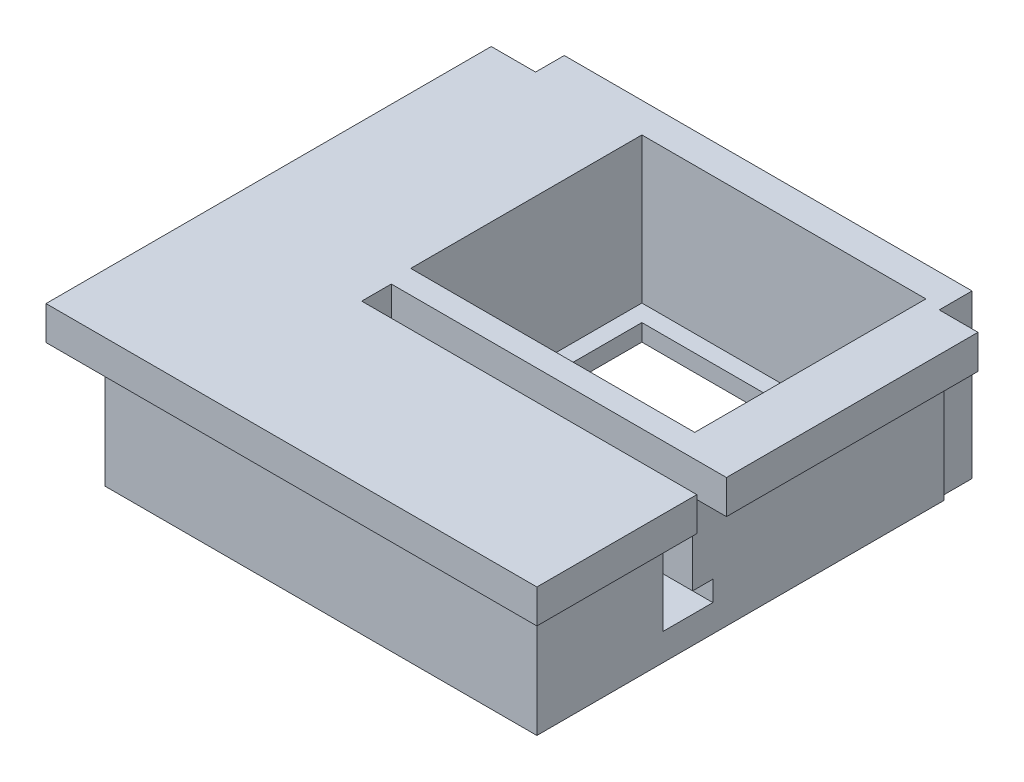
ISO-10303-21;
HEADER;
FILE_DESCRIPTION(('STEP AP214'),'2;1');
FILE_NAME('part.step','',(''),(''),'','','');
FILE_SCHEMA(('AUTOMOTIVE_DESIGN { 1 0 10303 214 1 1 1 1 }'));
ENDSEC;
DATA;
#1=APPLICATION_CONTEXT('core data for automotive mechanical design processes');
#2=APPLICATION_PROTOCOL_DEFINITION('international standard','automotive_design',2000,#1);
#3=PRODUCT_CONTEXT('',#1,'mechanical');
#4=PRODUCT('Part','Part','',(#3));
#5=PRODUCT_RELATED_PRODUCT_CATEGORY('part','',(#4));
#6=PRODUCT_DEFINITION_FORMATION('','',#4);
#7=PRODUCT_DEFINITION_CONTEXT('part definition',#1,'design');
#8=PRODUCT_DEFINITION('design','',#6,#7);
#9=PRODUCT_DEFINITION_SHAPE('','',#8);
#10=(LENGTH_UNIT() NAMED_UNIT(*) SI_UNIT(.MILLI.,.METRE.));
#11=(NAMED_UNIT(*) PLANE_ANGLE_UNIT() SI_UNIT($,.RADIAN.));
#12=(NAMED_UNIT(*) SI_UNIT($,.STERADIAN.) SOLID_ANGLE_UNIT());
#13=UNCERTAINTY_MEASURE_WITH_UNIT(LENGTH_MEASURE(1.E-05),#10,'distance_accuracy_value','');
#14=(GEOMETRIC_REPRESENTATION_CONTEXT(3) GLOBAL_UNCERTAINTY_ASSIGNED_CONTEXT((#13)) GLOBAL_UNIT_ASSIGNED_CONTEXT((#10,
#11,#12)) REPRESENTATION_CONTEXT('',''));
#15=CARTESIAN_POINT('',(0.,0.,0.));
#16=DIRECTION('',(0.,0.,1.));
#17=DIRECTION('',(1.,0.,0.));
#18=AXIS2_PLACEMENT_3D('',#15,#16,#17);
#19=CARTESIAN_POINT('',(-11.7306890976738,-0.899999999999993,-20.615205118863));
#20=DIRECTION('',(0.,0.,1.));
#21=DIRECTION('',(1.,0.,0.));
#22=AXIS2_PLACEMENT_3D('',#19,#20,#21);
#23=PLANE('',#22);
#24=DIRECTION('',(0.,1.,0.));
#25=VECTOR('',#24,1.);
#26=CARTESIAN_POINT('',(-11.7306890976738,-0.899999999999993,-20.615205118863));
#27=LINE('',#26,#25);
#28=CARTESIAN_POINT('',(-11.7306890976738,1.,-20.615205118863));
#29=VERTEX_POINT('',#28);
#30=CARTESIAN_POINT('',(-11.7306890976738,9.6,-20.615205118863));
#31=VERTEX_POINT('',#30);
#32=EDGE_CURVE('E380',#29,#31,#27,.T.);
#33=ORIENTED_EDGE('',*,*,#32,.F.);
#34=DIRECTION('',(-1.,0.,0.));
#35=VECTOR('',#34,1.);
#36=CARTESIAN_POINT('',(-27.5094484476645,1.,-20.615205118863));
#37=LINE('',#36,#35);
#38=CARTESIAN_POINT('',(-28.5094484476645,1.,-20.615205118863));
#39=VERTEX_POINT('',#38);
#40=EDGE_CURVE('E267',#29,#39,#37,.T.);
#41=ORIENTED_EDGE('',*,*,#40,.T.);
#42=DIRECTION('',(0.,1.,0.));
#43=VECTOR('',#42,1.);
#44=CARTESIAN_POINT('',(-28.5094484476645,-0.899999999999993,-20.615205118863));
#45=LINE('',#44,#43);
#46=CARTESIAN_POINT('',(-28.5094484476645,9.6,-20.615205118863));
#47=VERTEX_POINT('',#46);
#48=EDGE_CURVE('E383',#39,#47,#45,.T.);
#49=ORIENTED_EDGE('',*,*,#48,.T.);
#50=DIRECTION('',(1.,0.,0.));
#51=VECTOR('',#50,1.);
#52=CARTESIAN_POINT('',(-11.7306890976738,9.6,-20.615205118863));
#53=LINE('',#52,#51);
#54=EDGE_CURVE('E376',#47,#31,#53,.T.);
#55=ORIENTED_EDGE('',*,*,#54,.T.);
#56=EDGE_LOOP('',(#33,#41,#49,#55));
#57=FACE_BOUND('',#56,.T.);
#58=ADVANCED_FACE('F32',(#57),#23,.F.);
#59=CARTESIAN_POINT('',(-27.5094484476645,0.,0.));
#60=DIRECTION('',(-1.,0.,0.));
#61=DIRECTION('',(0.,0.,1.));
#62=AXIS2_PLACEMENT_3D('',#59,#60,#61);
#63=PLANE('',#62);
#64=DIRECTION('',(0.,1.,0.));
#65=VECTOR('',#64,1.);
#66=CARTESIAN_POINT('',(-27.5094484476645,0.,-21.615205118863));
#67=LINE('',#66,#65);
#68=CARTESIAN_POINT('',(-27.5094484476645,0.,-21.615205118863));
#69=VERTEX_POINT('',#68);
#70=CARTESIAN_POINT('',(-27.5094484476645,1.,-21.615205118863));
#71=VERTEX_POINT('',#70);
#72=EDGE_CURVE('E51',#69,#71,#67,.T.);
#73=ORIENTED_EDGE('',*,*,#72,.F.);
#74=DIRECTION('',(0.,0.,-1.));
#75=VECTOR('',#74,1.);
#76=CARTESIAN_POINT('',(-27.5094484476645,0.,-20.615205118863));
#77=LINE('',#76,#75);
#78=CARTESIAN_POINT('',(-27.5094484476645,0.,-33.2727785424468));
#79=VERTEX_POINT('',#78);
#80=EDGE_CURVE('E241',#69,#79,#77,.T.);
#81=ORIENTED_EDGE('',*,*,#80,.T.);
#82=DIRECTION('',(0.,-1.,0.));
#83=VECTOR('',#82,1.);
#84=CARTESIAN_POINT('',(-27.5094484476645,0.,-33.2727785424468));
#85=LINE('',#84,#83);
#86=CARTESIAN_POINT('',(-27.5094484476645,1.,-33.2727785424468));
#87=VERTEX_POINT('',#86);
#88=EDGE_CURVE('E256',#87,#79,#85,.T.);
#89=ORIENTED_EDGE('',*,*,#88,.F.);
#90=DIRECTION('',(0.,0.,1.));
#91=VECTOR('',#90,1.);
#92=CARTESIAN_POINT('',(-27.5094484476645,1.,-20.615205118863));
#93=LINE('',#92,#91);
#94=EDGE_CURVE('E47',#87,#71,#93,.T.);
#95=ORIENTED_EDGE('',*,*,#94,.T.);
#96=EDGE_LOOP('',(#73,#81,#89,#95));
#97=FACE_BOUND('',#96,.T.);
#98=ADVANCED_FACE('F558',(#97),#63,.F.);
#99=CARTESIAN_POINT('',(-12.7306890976738,0.,0.));
#100=DIRECTION('',(1.,0.,0.));
#101=DIRECTION('',(0.,0.,-1.));
#102=AXIS2_PLACEMENT_3D('',#99,#100,#101);
#103=PLANE('',#102);
#104=DIRECTION('',(0.,-1.,0.));
#105=VECTOR('',#104,1.);
#106=CARTESIAN_POINT('',(-12.7306890976738,0.,-21.615205118863));
#107=LINE('',#106,#105);
#108=CARTESIAN_POINT('',(-12.7306890976738,1.,-21.615205118863));
#109=VERTEX_POINT('',#108);
#110=CARTESIAN_POINT('',(-12.7306890976738,0.,-21.615205118863));
#111=VERTEX_POINT('',#110);
#112=EDGE_CURVE('E228',#109,#111,#107,.T.);
#113=ORIENTED_EDGE('',*,*,#112,.F.);
#114=DIRECTION('',(0.,0.,-1.));
#115=VECTOR('',#114,1.);
#116=CARTESIAN_POINT('',(-12.7306890976738,1.,-33.2727785424468));
#117=LINE('',#116,#115);
#118=CARTESIAN_POINT('',(-12.7306890976738,1.,-33.2727785424468));
#119=VERTEX_POINT('',#118);
#120=EDGE_CURVE('E235',#109,#119,#117,.T.);
#121=ORIENTED_EDGE('',*,*,#120,.T.);
#122=DIRECTION('',(0.,-1.,0.));
#123=VECTOR('',#122,1.);
#124=CARTESIAN_POINT('',(-12.7306890976738,0.,-33.2727785424468));
#125=LINE('',#124,#123);
#126=CARTESIAN_POINT('',(-12.7306890976738,0.,-33.2727785424468));
#127=VERTEX_POINT('',#126);
#128=EDGE_CURVE('E231',#119,#127,#125,.T.);
#129=ORIENTED_EDGE('',*,*,#128,.T.);
#130=DIRECTION('',(0.,0.,1.));
#131=VECTOR('',#130,1.);
#132=CARTESIAN_POINT('',(-12.7306890976738,0.,-33.2727785424468));
#133=LINE('',#132,#131);
#134=EDGE_CURVE('E224',#127,#111,#133,.T.);
#135=ORIENTED_EDGE('',*,*,#134,.T.);
#136=EDGE_LOOP('',(#113,#121,#129,#135));
#137=FACE_BOUND('',#136,.T.);
#138=ADVANCED_FACE('F226',(#137),#103,.F.);
#139=CARTESIAN_POINT('',(-11.7306890976738,-0.899999999999993,-34.2727785424468));
#140=DIRECTION('',(1.,0.,0.));
#141=DIRECTION('',(0.,0.,-1.));
#142=AXIS2_PLACEMENT_3D('',#139,#140,#141);
#143=PLANE('',#142);
#144=DIRECTION('',(0.,0.,-1.));
#145=VECTOR('',#144,1.);
#146=CARTESIAN_POINT('',(-11.7306890976738,1.,-33.2727785424468));
#147=LINE('',#146,#145);
#148=CARTESIAN_POINT('',(-11.7306890976738,1.,-34.2727785424468));
#149=VERTEX_POINT('',#148);
#150=EDGE_CURVE('E261',#29,#149,#147,.T.);
#151=ORIENTED_EDGE('',*,*,#150,.F.);
#152=ORIENTED_EDGE('',*,*,#32,.T.);
#153=DIRECTION('',(0.,0.,-1.));
#154=VECTOR('',#153,1.);
#155=CARTESIAN_POINT('',(-11.7306890976738,9.6,-34.2727785424468));
#156=LINE('',#155,#154);
#157=CARTESIAN_POINT('',(-11.7306890976738,9.6,-34.2727785424468));
#158=VERTEX_POINT('',#157);
#159=EDGE_CURVE('E364',#31,#158,#156,.T.);
#160=ORIENTED_EDGE('',*,*,#159,.T.);
#161=DIRECTION('',(0.,1.,0.));
#162=VECTOR('',#161,1.);
#163=CARTESIAN_POINT('',(-11.7306890976738,-0.899999999999993,-34.2727785424468));
#164=LINE('',#163,#162);
#165=EDGE_CURVE('E379',#149,#158,#164,.T.);
#166=ORIENTED_EDGE('',*,*,#165,.F.);
#167=EDGE_LOOP('',(#151,#152,#160,#166));
#168=FACE_BOUND('',#167,.T.);
#169=ADVANCED_FACE('F578',(#168),#143,.F.);
#170=CARTESIAN_POINT('',(0.,0.,-33.2727785424468));
#171=DIRECTION('',(0.,0.,1.));
#172=DIRECTION('',(1.,0.,0.));
#173=AXIS2_PLACEMENT_3D('',#170,#171,#172);
#174=PLANE('',#173);
#175=DIRECTION('',(1.,0.,0.));
#176=VECTOR('',#175,1.);
#177=CARTESIAN_POINT('',(-11.7306890976738,0.,-33.2727785424468));
#178=LINE('',#177,#176);
#179=EDGE_CURVE('E259',#79,#127,#178,.T.);
#180=ORIENTED_EDGE('',*,*,#179,.T.);
#181=ORIENTED_EDGE('',*,*,#128,.F.);
#182=DIRECTION('',(-1.,0.,0.));
#183=VECTOR('',#182,1.);
#184=CARTESIAN_POINT('',(-11.7306890976738,1.,-33.2727785424468));
#185=LINE('',#184,#183);
#186=EDGE_CURVE('E254',#119,#87,#185,.T.);
#187=ORIENTED_EDGE('',*,*,#186,.T.);
#188=ORIENTED_EDGE('',*,*,#88,.T.);
#189=EDGE_LOOP('',(#180,#181,#187,#188));
#190=FACE_BOUND('',#189,.T.);
#191=ADVANCED_FACE('F576',(#190),#174,.T.);
#192=CARTESIAN_POINT('',(-11.7306890976738,-0.899999999999993,-34.2727785424468));
#193=DIRECTION('',(0.,0.,-1.));
#194=DIRECTION('',(-1.,0.,0.));
#195=AXIS2_PLACEMENT_3D('',#192,#193,#194);
#196=PLANE('',#195);
#197=DIRECTION('',(-1.,0.,0.));
#198=VECTOR('',#197,1.);
#199=CARTESIAN_POINT('',(-27.5094484476645,1.,-34.2727785424468));
#200=LINE('',#199,#198);
#201=CARTESIAN_POINT('',(-28.5094484476645,1.,-34.2727785424468));
#202=VERTEX_POINT('',#201);
#203=EDGE_CURVE('E271',#149,#202,#200,.T.);
#204=ORIENTED_EDGE('',*,*,#203,.F.);
#205=ORIENTED_EDGE('',*,*,#165,.T.);
#206=DIRECTION('',(-1.,0.,0.));
#207=VECTOR('',#206,1.);
#208=CARTESIAN_POINT('',(-11.7306890976738,9.6,-34.2727785424468));
#209=LINE('',#208,#207);
#210=CARTESIAN_POINT('',(-28.5094484476645,9.6,-34.2727785424468));
#211=VERTEX_POINT('',#210);
#212=EDGE_CURVE('E370',#158,#211,#209,.T.);
#213=ORIENTED_EDGE('',*,*,#212,.T.);
#214=DIRECTION('',(0.,1.,0.));
#215=VECTOR('',#214,1.);
#216=CARTESIAN_POINT('',(-28.5094484476645,-0.899999999999993,-34.2727785424468));
#217=LINE('',#216,#215);
#218=EDGE_CURVE('E385',#202,#211,#217,.T.);
#219=ORIENTED_EDGE('',*,*,#218,.F.);
#220=EDGE_LOOP('',(#204,#205,#213,#219));
#221=FACE_BOUND('',#220,.T.);
#222=ADVANCED_FACE('F572',(#221),#196,.F.);
#223=CARTESIAN_POINT('',(-28.5094484476645,-0.899999999999993,-34.2727785424468));
#224=DIRECTION('',(-1.,0.,0.));
#225=DIRECTION('',(0.,0.,1.));
#226=AXIS2_PLACEMENT_3D('',#223,#224,#225);
#227=PLANE('',#226);
#228=DIRECTION('',(0.,0.,1.));
#229=VECTOR('',#228,1.);
#230=CARTESIAN_POINT('',(-28.5094484476645,1.,-20.615205118863));
#231=LINE('',#230,#229);
#232=EDGE_CURVE('E264',#202,#39,#231,.T.);
#233=ORIENTED_EDGE('',*,*,#232,.F.);
#234=ORIENTED_EDGE('',*,*,#218,.T.);
#235=DIRECTION('',(0.,0.,1.));
#236=VECTOR('',#235,1.);
#237=CARTESIAN_POINT('',(-28.5094484476645,9.6,-34.2727785424468));
#238=LINE('',#237,#236);
#239=EDGE_CURVE('E373',#211,#47,#238,.T.);
#240=ORIENTED_EDGE('',*,*,#239,.T.);
#241=ORIENTED_EDGE('',*,*,#48,.F.);
#242=EDGE_LOOP('',(#233,#234,#240,#241));
#243=FACE_BOUND('',#242,.T.);
#244=ADVANCED_FACE('F569',(#243),#227,.F.);
#245=CARTESIAN_POINT('',(-10.4837089162541,9.6,-36.0441553306199));
#246=DIRECTION('',(1.,0.,0.));
#247=DIRECTION('',(0.,0.,-1.));
#248=AXIS2_PLACEMENT_3D('',#245,#246,#247);
#249=PLANE('',#248);
#250=DIRECTION('',(0.,-1.,0.));
#251=VECTOR('',#250,1.);
#252=CARTESIAN_POINT('',(-10.4837089162541,9.6,-20.4439060026986));
#253=LINE('',#252,#251);
#254=CARTESIAN_POINT('',(-10.4837089162541,2.8,-20.4439060026986));
#255=VERTEX_POINT('',#254);
#256=CARTESIAN_POINT('',(-10.4837089162541,1.6,-20.4439060026986));
#257=VERTEX_POINT('',#256);
#258=EDGE_CURVE('E11',#255,#257,#253,.T.);
#259=ORIENTED_EDGE('',*,*,#258,.T.);
#260=DIRECTION('',(0.,0.,-1.));
#261=VECTOR('',#260,1.);
#262=CARTESIAN_POINT('',(-10.4837089162541,1.6,-19.2439060026986));
#263=LINE('',#262,#261);
#264=CARTESIAN_POINT('',(-10.4837089162541,1.6,-17.4939060026986));
#265=VERTEX_POINT('',#264);
#266=EDGE_CURVE('E388',#265,#257,#263,.T.);
#267=ORIENTED_EDGE('',*,*,#266,.F.);
#268=DIRECTION('',(0.,1.,0.));
#269=VECTOR('',#268,1.);
#270=CARTESIAN_POINT('',(-10.4837089162541,1.6,-17.4939060026986));
#271=LINE('',#270,#269);
#272=CARTESIAN_POINT('',(-10.4837089162541,7.60499689325916,-17.4939060026986));
#273=VERTEX_POINT('',#272);
#274=EDGE_CURVE('E404',#265,#273,#271,.T.);
#275=ORIENTED_EDGE('',*,*,#274,.T.);
#276=DIRECTION('',(0.,0.,-1.));
#277=VECTOR('',#276,1.);
#278=CARTESIAN_POINT('',(-10.4837089162541,7.60499689325916,-17.4939060026987));
#279=LINE('',#278,#277);
#280=CARTESIAN_POINT('',(-10.4837089162541,7.60499689325916,-10.0441553306199));
#281=VERTEX_POINT('',#280);
#282=EDGE_CURVE('E323',#281,#273,#279,.T.);
#283=ORIENTED_EDGE('',*,*,#282,.F.);
#284=DIRECTION('',(0.,-1.,0.));
#285=VECTOR('',#284,1.);
#286=CARTESIAN_POINT('',(-10.4837089162541,9.6,-10.0441553306199));
#287=LINE('',#286,#285);
#288=CARTESIAN_POINT('',(-10.4837089162541,0.,-10.0441553306199));
#289=VERTEX_POINT('',#288);
#290=EDGE_CURVE('E436',#281,#289,#287,.T.);
#291=ORIENTED_EDGE('',*,*,#290,.T.);
#292=DIRECTION('',(0.,0.,1.));
#293=VECTOR('',#292,1.);
#294=CARTESIAN_POINT('',(-10.4837089162541,0.,-36.0441553306199));
#295=LINE('',#294,#293);
#296=CARTESIAN_POINT('',(-10.4837089162541,0.,-34.1040936175858));
#297=VERTEX_POINT('',#296);
#298=EDGE_CURVE('E443',#297,#289,#295,.T.);
#299=ORIENTED_EDGE('',*,*,#298,.F.);
#300=DIRECTION('',(0.,1.,0.));
#301=VECTOR('',#300,1.);
#302=CARTESIAN_POINT('',(-10.4837089162541,-0.899999999999993,-34.1040936175858));
#303=LINE('',#302,#301);
#304=CARTESIAN_POINT('',(-10.4837089162541,7.59760581567187,-34.1040936175858));
#305=VERTEX_POINT('',#304);
#306=EDGE_CURVE('E362',#297,#305,#303,.T.);
#307=ORIENTED_EDGE('',*,*,#306,.T.);
#308=DIRECTION('',(0.,0.,-1.));
#309=VECTOR('',#308,1.);
#310=CARTESIAN_POINT('',(-10.4837089162541,7.59760581567187,-34.1040936175858));
#311=LINE('',#310,#309);
#312=CARTESIAN_POINT('',(-10.4837089162541,7.59760581567187,-19.2439060026986));
#313=VERTEX_POINT('',#312);
#314=EDGE_CURVE('E337',#313,#305,#311,.T.);
#315=ORIENTED_EDGE('',*,*,#314,.F.);
#316=DIRECTION('',(0.,1.,0.));
#317=VECTOR('',#316,1.);
#318=CARTESIAN_POINT('',(-10.4837089162541,1.6,-19.2439060026986));
#319=LINE('',#318,#317);
#320=CARTESIAN_POINT('',(-10.4837089162541,2.8,-19.2439060026986));
#321=VERTEX_POINT('',#320);
#322=EDGE_CURVE('E397',#321,#313,#319,.T.);
#323=ORIENTED_EDGE('',*,*,#322,.F.);
#324=DIRECTION('',(0.,0.,-1.));
#325=VECTOR('',#324,1.);
#326=CARTESIAN_POINT('',(-10.4837089162541,2.8,-36.0441553306199));
#327=LINE('',#326,#325);
#328=EDGE_CURVE('E295',#321,#255,#327,.T.);
#329=ORIENTED_EDGE('',*,*,#328,.T.);
#330=EDGE_LOOP('',(#259,#267,#275,#283,#291,#299,#307,#315,#323,#329));
#331=FACE_BOUND('',#330,.T.);
#332=ADVANCED_FACE('F459',(#331),#249,.T.);
#333=CARTESIAN_POINT('',(-10.4837089162541,1.6,-19.2439060026986));
#334=DIRECTION('',(0.,0.,-1.));
#335=DIRECTION('',(-1.,0.,0.));
#336=AXIS2_PLACEMENT_3D('',#333,#334,#335);
#337=PLANE('',#336);
#338=DIRECTION('',(-1.,0.,0.));
#339=VECTOR('',#338,1.);
#340=CARTESIAN_POINT('',(-8.48370891625406,2.8,-19.2439060026986));
#341=LINE('',#340,#339);
#342=CARTESIAN_POINT('',(-28.2841164893821,2.8,-19.2439060026986));
#343=VERTEX_POINT('',#342);
#344=EDGE_CURVE('E288',#321,#343,#341,.T.);
#345=ORIENTED_EDGE('',*,*,#344,.F.);
#346=ORIENTED_EDGE('',*,*,#322,.T.);
#347=DIRECTION('',(-1.,0.,0.));
#348=VECTOR('',#347,1.);
#349=CARTESIAN_POINT('',(-8.48370891625406,7.59760581567187,-19.2439060026986));
#350=LINE('',#349,#348);
#351=CARTESIAN_POINT('',(-8.48370891625406,7.59760581567187,-19.2439060026986));
#352=VERTEX_POINT('',#351);
#353=EDGE_CURVE('E353',#352,#313,#350,.T.);
#354=ORIENTED_EDGE('',*,*,#353,.F.);
#355=DIRECTION('',(0.,-1.,0.));
#356=VECTOR('',#355,1.);
#357=CARTESIAN_POINT('',(-8.48370891625406,9.6,-19.2439060026986));
#358=LINE('',#357,#356);
#359=CARTESIAN_POINT('',(-8.48370891625406,9.6,-19.2439060026986));
#360=VERTEX_POINT('',#359);
#361=EDGE_CURVE('E344',#360,#352,#358,.T.);
#362=ORIENTED_EDGE('',*,*,#361,.F.);
#363=DIRECTION('',(-1.,0.,0.));
#364=VECTOR('',#363,1.);
#365=CARTESIAN_POINT('',(-10.4837089162541,9.6,-19.2439060026986));
#366=LINE('',#365,#364);
#367=CARTESIAN_POINT('',(-28.2841164893821,9.6,-19.2439060026986));
#368=VERTEX_POINT('',#367);
#369=EDGE_CURVE('E382',#360,#368,#366,.T.);
#370=ORIENTED_EDGE('',*,*,#369,.T.);
#371=DIRECTION('',(0.,1.,0.));
#372=VECTOR('',#371,1.);
#373=CARTESIAN_POINT('',(-28.2841164893821,1.6,-19.2439060026986));
#374=LINE('',#373,#372);
#375=EDGE_CURVE('E412',#343,#368,#374,.T.);
#376=ORIENTED_EDGE('',*,*,#375,.F.);
#377=EDGE_LOOP('',(#345,#346,#354,#362,#370,#376));
#378=FACE_BOUND('',#377,.T.);
#379=ADVANCED_FACE('F505',(#378),#337,.F.);
#380=CARTESIAN_POINT('',(-35.9837089162541,9.6,-36.0441553306199));
#381=DIRECTION('',(1.,0.,0.));
#382=DIRECTION('',(0.,0.,-1.));
#383=AXIS2_PLACEMENT_3D('',#380,#381,#382);
#384=PLANE('',#383);
#385=DIRECTION('',(0.,0.,1.));
#386=VECTOR('',#385,1.);
#387=CARTESIAN_POINT('',(-35.9837089162541,7.60499689325916,-34.3486274307681));
#388=LINE('',#387,#386);
#389=CARTESIAN_POINT('',(-35.9837089162541,7.60499689325916,-34.3486274307681));
#390=VERTEX_POINT('',#389);
#391=CARTESIAN_POINT('',(-35.9837089162541,7.60499689325916,-10.0441553306199));
#392=VERTEX_POINT('',#391);
#393=EDGE_CURVE('E298',#390,#392,#388,.T.);
#394=ORIENTED_EDGE('',*,*,#393,.F.);
#395=DIRECTION('',(0.,1.,0.));
#396=VECTOR('',#395,1.);
#397=CARTESIAN_POINT('',(-35.9837089162541,0.,-34.3486274307681));
#398=LINE('',#397,#396);
#399=CARTESIAN_POINT('',(-35.9837089162541,0.,-34.3486274307681));
#400=VERTEX_POINT('',#399);
#401=EDGE_CURVE('E421',#400,#390,#398,.T.);
#402=ORIENTED_EDGE('',*,*,#401,.F.);
#403=DIRECTION('',(0.,0.,1.));
#404=VECTOR('',#403,1.);
#405=CARTESIAN_POINT('',(-35.9837089162541,0.,-36.0441553306199));
#406=LINE('',#405,#404);
#407=CARTESIAN_POINT('',(-35.9837089162541,0.,-10.0441553306199));
#408=VERTEX_POINT('',#407);
#409=EDGE_CURVE('E428',#400,#408,#406,.T.);
#410=ORIENTED_EDGE('',*,*,#409,.T.);
#411=DIRECTION('',(0.,-1.,0.));
#412=VECTOR('',#411,1.);
#413=CARTESIAN_POINT('',(-35.9837089162541,9.6,-10.0441553306199));
#414=LINE('',#413,#412);
#415=EDGE_CURVE('E449',#392,#408,#414,.T.);
#416=ORIENTED_EDGE('',*,*,#415,.F.);
#417=EDGE_LOOP('',(#394,#402,#410,#416));
#418=FACE_BOUND('',#417,.T.);
#419=ADVANCED_FACE('F34',(#418),#384,.F.);
#420=CARTESIAN_POINT('',(-35.9837089162541,9.6,-10.0441553306199));
#421=DIRECTION('',(0.,0.,-1.));
#422=DIRECTION('',(-1.,0.,0.));
#423=AXIS2_PLACEMENT_3D('',#420,#421,#422);
#424=PLANE('',#423);
#425=DIRECTION('',(1.,0.,0.));
#426=VECTOR('',#425,1.);
#427=CARTESIAN_POINT('',(-35.9837089162541,7.60499689325916,-10.0441553306199));
#428=LINE('',#427,#426);
#429=EDGE_CURVE('E314',#392,#281,#428,.T.);
#430=ORIENTED_EDGE('',*,*,#429,.F.);
#431=ORIENTED_EDGE('',*,*,#415,.T.);
#432=DIRECTION('',(1.,0.,0.));
#433=VECTOR('',#432,1.);
#434=CARTESIAN_POINT('',(-35.9837089162541,0.,-10.0441553306199));
#435=LINE('',#434,#433);
#436=EDGE_CURVE('E440',#408,#289,#435,.T.);
#437=ORIENTED_EDGE('',*,*,#436,.T.);
#438=ORIENTED_EDGE('',*,*,#290,.F.);
#439=EDGE_LOOP('',(#430,#431,#437,#438));
#440=FACE_BOUND('',#439,.T.);
#441=ADVANCED_FACE('F465',(#440),#424,.F.);
#442=CARTESIAN_POINT('',(-35.9837089162541,9.6,-36.0441553306199));
#443=DIRECTION('',(0.,0.,-1.));
#444=DIRECTION('',(-1.,0.,0.));
#445=AXIS2_PLACEMENT_3D('',#442,#443,#444);
#446=PLANE('',#445);
#447=DIRECTION('',(0.,1.,0.));
#448=VECTOR('',#447,1.);
#449=CARTESIAN_POINT('',(-10.7750733303646,-0.899999999999993,-36.0441553306199));
#450=LINE('',#449,#448);
#451=CARTESIAN_POINT('',(-10.7750733303646,0.,-36.0441553306199));
#452=VERTEX_POINT('',#451);
#453=CARTESIAN_POINT('',(-10.7750733303646,9.6,-36.0441553306199));
#454=VERTEX_POINT('',#453);
#455=EDGE_CURVE('E361',#452,#454,#450,.T.);
#456=ORIENTED_EDGE('',*,*,#455,.F.);
#457=DIRECTION('',(1.,0.,0.));
#458=VECTOR('',#457,1.);
#459=CARTESIAN_POINT('',(-35.9837089162541,0.,-36.0441553306199));
#460=LINE('',#459,#458);
#461=CARTESIAN_POINT('',(-34.8665316452555,0.,-36.0441553306199));
#462=VERTEX_POINT('',#461);
#463=EDGE_CURVE('E437',#462,#452,#460,.T.);
#464=ORIENTED_EDGE('',*,*,#463,.F.);
#465=DIRECTION('',(0.,1.,0.));
#466=VECTOR('',#465,1.);
#467=CARTESIAN_POINT('',(-34.8665316452555,0.,-36.0441553306199));
#468=LINE('',#467,#466);
#469=CARTESIAN_POINT('',(-34.8665316452555,9.6,-36.0441553306199));
#470=VERTEX_POINT('',#469);
#471=EDGE_CURVE('E425',#462,#470,#468,.T.);
#472=ORIENTED_EDGE('',*,*,#471,.T.);
#473=DIRECTION('',(1.,0.,0.));
#474=VECTOR('',#473,1.);
#475=CARTESIAN_POINT('',(-35.9837089162541,9.6,-36.0441553306199));
#476=LINE('',#475,#474);
#477=EDGE_CURVE('E433',#470,#454,#476,.T.);
#478=ORIENTED_EDGE('',*,*,#477,.T.);
#479=EDGE_LOOP('',(#456,#464,#472,#478));
#480=FACE_BOUND('',#479,.T.);
#481=ADVANCED_FACE('F482',(#480),#446,.T.);
#482=CARTESIAN_POINT('',(0.,9.6,0.));
#483=DIRECTION('',(0.,1.,0.));
#484=DIRECTION('',(0.,0.,1.));
#485=AXIS2_PLACEMENT_3D('',#482,#483,#484);
#486=PLANE('',#485);
#487=DIRECTION('',(1.,0.,0.));
#488=VECTOR('',#487,1.);
#489=CARTESIAN_POINT('',(-10.4837089162541,9.6,-34.1040936175858));
#490=LINE('',#489,#488);
#491=CARTESIAN_POINT('',(-10.7750733303646,9.6,-34.1040936175858));
#492=VERTEX_POINT('',#491);
#493=CARTESIAN_POINT('',(-8.48370891625407,9.6,-34.1040936175858));
#494=VERTEX_POINT('',#493);
#495=EDGE_CURVE('E359',#492,#494,#490,.T.);
#496=ORIENTED_EDGE('',*,*,#495,.F.);
#497=DIRECTION('',(0.,0.,1.));
#498=VECTOR('',#497,1.);
#499=CARTESIAN_POINT('',(-10.7750733303646,9.6,-36.0441553306199));
#500=LINE('',#499,#498);
#501=EDGE_CURVE('E356',#454,#492,#500,.T.);
#502=ORIENTED_EDGE('',*,*,#501,.F.);
#503=ORIENTED_EDGE('',*,*,#477,.F.);
#504=DIRECTION('',(0.,0.,-1.));
#505=VECTOR('',#504,1.);
#506=CARTESIAN_POINT('',(-34.8665316452555,9.6,-36.0441553306199));
#507=LINE('',#506,#505);
#508=CARTESIAN_POINT('',(-34.8665316452555,9.6,-34.3486274307681));
#509=VERTEX_POINT('',#508);
#510=EDGE_CURVE('E418',#509,#470,#507,.T.);
#511=ORIENTED_EDGE('',*,*,#510,.F.);
#512=DIRECTION('',(1.,0.,0.));
#513=VECTOR('',#512,1.);
#514=CARTESIAN_POINT('',(-35.9837089162541,9.6,-34.3486274307681));
#515=LINE('',#514,#513);
#516=CARTESIAN_POINT('',(-37.4837089162541,9.6,-34.3486274307681));
#517=VERTEX_POINT('',#516);
#518=EDGE_CURVE('E406',#517,#509,#515,.T.);
#519=ORIENTED_EDGE('',*,*,#518,.F.);
#520=DIRECTION('',(0.,0.,-1.));
#521=VECTOR('',#520,1.);
#522=CARTESIAN_POINT('',(-37.4837089162541,9.6,-34.3486274307681));
#523=LINE('',#522,#521);
#524=CARTESIAN_POINT('',(-37.4837089162541,9.6,-8.04415533061993));
#525=VERTEX_POINT('',#524);
#526=EDGE_CURVE('E308',#525,#517,#523,.T.);
#527=ORIENTED_EDGE('',*,*,#526,.F.);
#528=DIRECTION('',(-1.,0.,0.));
#529=VECTOR('',#528,1.);
#530=CARTESIAN_POINT('',(-35.9837089162541,9.6,-8.04415533061993));
#531=LINE('',#530,#529);
#532=CARTESIAN_POINT('',(-8.48370891625406,9.6,-8.04415533061993));
#533=VERTEX_POINT('',#532);
#534=EDGE_CURVE('E321',#533,#525,#531,.T.);
#535=ORIENTED_EDGE('',*,*,#534,.F.);
#536=DIRECTION('',(0.,0.,1.));
#537=VECTOR('',#536,1.);
#538=CARTESIAN_POINT('',(-8.48370891625406,9.6,-17.4939060026987));
#539=LINE('',#538,#537);
#540=CARTESIAN_POINT('',(-8.48370891625406,9.6,-17.4939060026987));
#541=VERTEX_POINT('',#540);
#542=EDGE_CURVE('E328',#541,#533,#539,.T.);
#543=ORIENTED_EDGE('',*,*,#542,.F.);
#544=DIRECTION('',(1.,0.,0.));
#545=VECTOR('',#544,1.);
#546=CARTESIAN_POINT('',(-10.4837089162541,9.6,-17.4939060026986));
#547=LINE('',#546,#545);
#548=CARTESIAN_POINT('',(-28.2841164893821,9.6,-17.4939060026986));
#549=VERTEX_POINT('',#548);
#550=EDGE_CURVE('E391',#549,#541,#547,.T.);
#551=ORIENTED_EDGE('',*,*,#550,.F.);
#552=DIRECTION('',(0.,0.,1.));
#553=VECTOR('',#552,1.);
#554=CARTESIAN_POINT('',(-28.2841164893821,9.6,-19.2439060026986));
#555=LINE('',#554,#553);
#556=EDGE_CURVE('E400',#368,#549,#555,.T.);
#557=ORIENTED_EDGE('',*,*,#556,.F.);
#558=ORIENTED_EDGE('',*,*,#369,.F.);
#559=DIRECTION('',(0.,0.,1.));
#560=VECTOR('',#559,1.);
#561=CARTESIAN_POINT('',(-8.48370891625407,9.6,-34.1040936175858));
#562=LINE('',#561,#560);
#563=EDGE_CURVE('E341',#494,#360,#562,.T.);
#564=ORIENTED_EDGE('',*,*,#563,.F.);
#565=EDGE_LOOP('',(#496,#502,#503,#511,#519,#527,#535,#543,#551,#557,#558,#564));
#566=FACE_BOUND('',#565,.T.);
#567=ORIENTED_EDGE('',*,*,#159,.F.);
#568=ORIENTED_EDGE('',*,*,#54,.F.);
#569=ORIENTED_EDGE('',*,*,#239,.F.);
#570=ORIENTED_EDGE('',*,*,#212,.F.);
#571=EDGE_LOOP('',(#567,#568,#569,#570));
#572=FACE_BOUND('',#571,.T.);
#573=ADVANCED_FACE('F489',(#566,#572),#486,.T.);
#574=CARTESIAN_POINT('',(0.,0.,0.));
#575=DIRECTION('',(0.,1.,0.));
#576=DIRECTION('',(0.,0.,1.));
#577=AXIS2_PLACEMENT_3D('',#574,#575,#576);
#578=PLANE('',#577);
#579=ORIENTED_EDGE('',*,*,#80,.F.);
#580=DIRECTION('',(-1.,0.,0.));
#581=VECTOR('',#580,1.);
#582=CARTESIAN_POINT('',(-12.7306890976738,0.,-21.615205118863));
#583=LINE('',#582,#581);
#584=EDGE_CURVE('E238',#111,#69,#583,.T.);
#585=ORIENTED_EDGE('',*,*,#584,.F.);
#586=ORIENTED_EDGE('',*,*,#134,.F.);
#587=ORIENTED_EDGE('',*,*,#179,.F.);
#588=EDGE_LOOP('',(#579,#585,#586,#587));
#589=FACE_BOUND('',#588,.T.);
#590=DIRECTION('',(0.,0.,1.));
#591=VECTOR('',#590,1.);
#592=CARTESIAN_POINT('',(-10.7750733303646,0.,0.));
#593=LINE('',#592,#591);
#594=CARTESIAN_POINT('',(-10.7750733303646,0.,-34.1040936175858));
#595=VERTEX_POINT('',#594);
#596=EDGE_CURVE('E451',#452,#595,#593,.T.);
#597=ORIENTED_EDGE('',*,*,#596,.T.);
#598=DIRECTION('',(1.,0.,0.));
#599=VECTOR('',#598,1.);
#600=CARTESIAN_POINT('',(0.,0.,-34.1040936175858));
#601=LINE('',#600,#599);
#602=EDGE_CURVE('E40',#595,#297,#601,.T.);
#603=ORIENTED_EDGE('',*,*,#602,.T.);
#604=ORIENTED_EDGE('',*,*,#298,.T.);
#605=ORIENTED_EDGE('',*,*,#436,.F.);
#606=ORIENTED_EDGE('',*,*,#409,.F.);
#607=DIRECTION('',(1.,0.,0.));
#608=VECTOR('',#607,1.);
#609=CARTESIAN_POINT('',(-35.9837089162541,0.,-34.3486274307681));
#610=LINE('',#609,#608);
#611=CARTESIAN_POINT('',(-34.8665316452555,0.,-34.3486274307681));
#612=VERTEX_POINT('',#611);
#613=EDGE_CURVE('E414',#400,#612,#610,.T.);
#614=ORIENTED_EDGE('',*,*,#613,.T.);
#615=DIRECTION('',(0.,0.,-1.));
#616=VECTOR('',#615,1.);
#617=CARTESIAN_POINT('',(-34.8665316452555,0.,-36.0441553306199));
#618=LINE('',#617,#616);
#619=EDGE_CURVE('E417',#612,#462,#618,.T.);
#620=ORIENTED_EDGE('',*,*,#619,.T.);
#621=ORIENTED_EDGE('',*,*,#463,.T.);
#622=EDGE_LOOP('',(#597,#603,#604,#605,#606,#614,#620,#621));
#623=FACE_BOUND('',#622,.T.);
#624=ADVANCED_FACE('F239',(#589,#623),#578,.F.);
#625=CARTESIAN_POINT('',(-34.8665316452555,0.,-36.0441553306199));
#626=DIRECTION('',(1.,0.,0.));
#627=DIRECTION('',(0.,0.,-1.));
#628=AXIS2_PLACEMENT_3D('',#625,#626,#627);
#629=PLANE('',#628);
#630=ORIENTED_EDGE('',*,*,#510,.T.);
#631=ORIENTED_EDGE('',*,*,#471,.F.);
#632=ORIENTED_EDGE('',*,*,#619,.F.);
#633=DIRECTION('',(0.,1.,0.));
#634=VECTOR('',#633,1.);
#635=CARTESIAN_POINT('',(-34.8665316452555,0.,-34.3486274307681));
#636=LINE('',#635,#634);
#637=EDGE_CURVE('E429',#612,#509,#636,.T.);
#638=ORIENTED_EDGE('',*,*,#637,.T.);
#639=EDGE_LOOP('',(#630,#631,#632,#638));
#640=FACE_BOUND('',#639,.T.);
#641=ADVANCED_FACE('F478',(#640),#629,.F.);
#642=CARTESIAN_POINT('',(-35.9837089162541,0.,-34.3486274307681));
#643=DIRECTION('',(0.,0.,1.));
#644=DIRECTION('',(1.,0.,0.));
#645=AXIS2_PLACEMENT_3D('',#642,#643,#644);
#646=PLANE('',#645);
#647=ORIENTED_EDGE('',*,*,#518,.T.);
#648=ORIENTED_EDGE('',*,*,#637,.F.);
#649=ORIENTED_EDGE('',*,*,#613,.F.);
#650=ORIENTED_EDGE('',*,*,#401,.T.);
#651=DIRECTION('',(1.,0.,0.));
#652=VECTOR('',#651,1.);
#653=CARTESIAN_POINT('',(-37.4837089162541,7.60499689325916,-34.3486274307681));
#654=LINE('',#653,#652);
#655=CARTESIAN_POINT('',(-37.4837089162541,7.60499689325916,-34.3486274307681));
#656=VERTEX_POINT('',#655);
#657=EDGE_CURVE('E311',#656,#390,#654,.T.);
#658=ORIENTED_EDGE('',*,*,#657,.F.);
#659=DIRECTION('',(0.,-1.,0.));
#660=VECTOR('',#659,1.);
#661=CARTESIAN_POINT('',(-37.4837089162541,9.6,-34.3486274307681));
#662=LINE('',#661,#660);
#663=EDGE_CURVE('E299',#517,#656,#662,.T.);
#664=ORIENTED_EDGE('',*,*,#663,.F.);
#665=EDGE_LOOP('',(#647,#648,#649,#650,#658,#664));
#666=FACE_BOUND('',#665,.T.);
#667=ADVANCED_FACE('F473',(#666),#646,.F.);
#668=CARTESIAN_POINT('',(-10.4837089162541,1.6,-17.4939060026986));
#669=DIRECTION('',(0.,0.,1.));
#670=DIRECTION('',(1.,0.,0.));
#671=AXIS2_PLACEMENT_3D('',#668,#669,#670);
#672=PLANE('',#671);
#673=ORIENTED_EDGE('',*,*,#550,.T.);
#674=DIRECTION('',(0.,1.,0.));
#675=VECTOR('',#674,1.);
#676=CARTESIAN_POINT('',(-8.48370891625406,9.6,-17.4939060026987));
#677=LINE('',#676,#675);
#678=CARTESIAN_POINT('',(-8.48370891625406,7.60499689325916,-17.4939060026987));
#679=VERTEX_POINT('',#678);
#680=EDGE_CURVE('E325',#679,#541,#677,.T.);
#681=ORIENTED_EDGE('',*,*,#680,.F.);
#682=DIRECTION('',(-1.,0.,0.));
#683=VECTOR('',#682,1.);
#684=CARTESIAN_POINT('',(-8.48370891625406,7.60499689325916,-17.4939060026987));
#685=LINE('',#684,#683);
#686=EDGE_CURVE('E332',#679,#273,#685,.T.);
#687=ORIENTED_EDGE('',*,*,#686,.T.);
#688=ORIENTED_EDGE('',*,*,#274,.F.);
#689=DIRECTION('',(1.,0.,0.));
#690=VECTOR('',#689,1.);
#691=CARTESIAN_POINT('',(-10.4837089162541,1.6,-17.4939060026986));
#692=LINE('',#691,#690);
#693=CARTESIAN_POINT('',(-28.2841164893821,1.6,-17.4939060026986));
#694=VERTEX_POINT('',#693);
#695=EDGE_CURVE('E394',#694,#265,#692,.T.);
#696=ORIENTED_EDGE('',*,*,#695,.F.);
#697=DIRECTION('',(0.,1.,0.));
#698=VECTOR('',#697,1.);
#699=CARTESIAN_POINT('',(-28.2841164893821,1.6,-17.4939060026986));
#700=LINE('',#699,#698);
#701=EDGE_CURVE('E407',#694,#549,#700,.T.);
#702=ORIENTED_EDGE('',*,*,#701,.T.);
#703=EDGE_LOOP('',(#673,#681,#687,#688,#696,#702));
#704=FACE_BOUND('',#703,.T.);
#705=ADVANCED_FACE('F530',(#704),#672,.F.);
#706=CARTESIAN_POINT('',(-28.2841164893821,1.6,-19.2439060026986));
#707=DIRECTION('',(-1.,0.,0.));
#708=DIRECTION('',(0.,0.,1.));
#709=AXIS2_PLACEMENT_3D('',#706,#707,#708);
#710=PLANE('',#709);
#711=ORIENTED_EDGE('',*,*,#556,.T.);
#712=ORIENTED_EDGE('',*,*,#701,.F.);
#713=DIRECTION('',(0.,0.,1.));
#714=VECTOR('',#713,1.);
#715=CARTESIAN_POINT('',(-28.2841164893821,1.6,-19.2439060026986));
#716=LINE('',#715,#714);
#717=CARTESIAN_POINT('',(-28.2841164893821,1.6,-19.2439060026986));
#718=VERTEX_POINT('',#717);
#719=EDGE_CURVE('E390',#718,#694,#716,.T.);
#720=ORIENTED_EDGE('',*,*,#719,.F.);
#721=EDGE_CURVE('E409',#718,#343,#374,.T.);
#722=ORIENTED_EDGE('',*,*,#721,.T.);
#723=ORIENTED_EDGE('',*,*,#375,.T.);
#724=EDGE_LOOP('',(#711,#712,#720,#722,#723));
#725=FACE_BOUND('',#724,.T.);
#726=ADVANCED_FACE('F545',(#725),#710,.F.);
#727=CARTESIAN_POINT('',(0.,1.6,0.));
#728=DIRECTION('',(0.,-1.,0.));
#729=DIRECTION('',(0.,0.,-1.));
#730=AXIS2_PLACEMENT_3D('',#727,#728,#729);
#731=PLANE('',#730);
#732=ORIENTED_EDGE('',*,*,#266,.T.);
#733=DIRECTION('',(-1.,0.,0.));
#734=VECTOR('',#733,1.);
#735=CARTESIAN_POINT('',(-8.48370891625406,1.6,-20.4439060026986));
#736=LINE('',#735,#734);
#737=CARTESIAN_POINT('',(-28.9837089162541,1.6,-20.4439060026986));
#738=VERTEX_POINT('',#737);
#739=EDGE_CURVE('E291',#257,#738,#736,.T.);
#740=ORIENTED_EDGE('',*,*,#739,.T.);
#741=DIRECTION('',(0.,0.,-1.));
#742=VECTOR('',#741,1.);
#743=CARTESIAN_POINT('',(-28.9837089162541,1.6,-19.2439060026986));
#744=LINE('',#743,#742);
#745=CARTESIAN_POINT('',(-28.9837089162541,1.6,-19.2439060026986));
#746=VERTEX_POINT('',#745);
#747=EDGE_CURVE('E277',#746,#738,#744,.T.);
#748=ORIENTED_EDGE('',*,*,#747,.F.);
#749=DIRECTION('',(-1.,0.,0.));
#750=VECTOR('',#749,1.);
#751=CARTESIAN_POINT('',(-8.48370891625406,1.6,-19.2439060026986));
#752=LINE('',#751,#750);
#753=EDGE_CURVE('E293',#718,#746,#752,.T.);
#754=ORIENTED_EDGE('',*,*,#753,.F.);
#755=ORIENTED_EDGE('',*,*,#719,.T.);
#756=ORIENTED_EDGE('',*,*,#695,.T.);
#757=EDGE_LOOP('',(#732,#740,#748,#754,#755,#756));
#758=FACE_BOUND('',#757,.T.);
#759=ADVANCED_FACE('F521',(#758),#731,.F.);
#760=CARTESIAN_POINT('',(-10.4837089162541,-0.899999999999993,-34.1040936175858));
#761=DIRECTION('',(0.,0.,1.));
#762=DIRECTION('',(1.,0.,0.));
#763=AXIS2_PLACEMENT_3D('',#760,#761,#762);
#764=PLANE('',#763);
#765=DIRECTION('',(0.,1.,0.));
#766=VECTOR('',#765,1.);
#767=CARTESIAN_POINT('',(-10.7750733303646,-0.899999999999993,-34.1040936175858));
#768=LINE('',#767,#766);
#769=EDGE_CURVE('E365',#595,#492,#768,.T.);
#770=ORIENTED_EDGE('',*,*,#769,.T.);
#771=ORIENTED_EDGE('',*,*,#495,.T.);
#772=DIRECTION('',(0.,1.,0.));
#773=VECTOR('',#772,1.);
#774=CARTESIAN_POINT('',(-8.48370891625407,9.6,-34.1040936175858));
#775=LINE('',#774,#773);
#776=CARTESIAN_POINT('',(-8.48370891625407,7.59760581567187,-34.1040936175858));
#777=VERTEX_POINT('',#776);
#778=EDGE_CURVE('E338',#777,#494,#775,.T.);
#779=ORIENTED_EDGE('',*,*,#778,.F.);
#780=DIRECTION('',(-1.,0.,0.));
#781=VECTOR('',#780,1.);
#782=CARTESIAN_POINT('',(-8.48370891625407,7.59760581567187,-34.1040936175858));
#783=LINE('',#782,#781);
#784=EDGE_CURVE('E348',#777,#305,#783,.T.);
#785=ORIENTED_EDGE('',*,*,#784,.T.);
#786=ORIENTED_EDGE('',*,*,#306,.F.);
#787=ORIENTED_EDGE('',*,*,#602,.F.);
#788=EDGE_LOOP('',(#770,#771,#779,#785,#786,#787));
#789=FACE_BOUND('',#788,.T.);
#790=ADVANCED_FACE('F493',(#789),#764,.F.);
#791=CARTESIAN_POINT('',(-10.7750733303646,-0.899999999999993,-36.0441553306199));
#792=DIRECTION('',(-1.,0.,0.));
#793=DIRECTION('',(0.,0.,1.));
#794=AXIS2_PLACEMENT_3D('',#791,#792,#793);
#795=PLANE('',#794);
#796=ORIENTED_EDGE('',*,*,#455,.T.);
#797=ORIENTED_EDGE('',*,*,#501,.T.);
#798=ORIENTED_EDGE('',*,*,#769,.F.);
#799=ORIENTED_EDGE('',*,*,#596,.F.);
#800=EDGE_LOOP('',(#796,#797,#798,#799));
#801=FACE_BOUND('',#800,.T.);
#802=ADVANCED_FACE('F486',(#801),#795,.F.);
#803=CARTESIAN_POINT('',(-8.48370891625407,7.59760581567187,-34.1040936175858));
#804=DIRECTION('',(0.,1.,0.));
#805=DIRECTION('',(0.,0.,1.));
#806=AXIS2_PLACEMENT_3D('',#803,#804,#805);
#807=PLANE('',#806);
#808=ORIENTED_EDGE('',*,*,#314,.T.);
#809=ORIENTED_EDGE('',*,*,#784,.F.);
#810=DIRECTION('',(0.,0.,-1.));
#811=VECTOR('',#810,1.);
#812=CARTESIAN_POINT('',(-8.48370891625407,7.59760581567187,-34.1040936175858));
#813=LINE('',#812,#811);
#814=EDGE_CURVE('E346',#352,#777,#813,.T.);
#815=ORIENTED_EDGE('',*,*,#814,.F.);
#816=ORIENTED_EDGE('',*,*,#353,.T.);
#817=EDGE_LOOP('',(#808,#809,#815,#816));
#818=FACE_BOUND('',#817,.T.);
#819=ADVANCED_FACE('F501',(#818),#807,.F.);
#820=CARTESIAN_POINT('',(-8.48370891625406,0.,0.));
#821=DIRECTION('',(-1.,0.,0.));
#822=DIRECTION('',(0.,0.,1.));
#823=AXIS2_PLACEMENT_3D('',#820,#821,#822);
#824=PLANE('',#823);
#825=ORIENTED_EDGE('',*,*,#778,.T.);
#826=ORIENTED_EDGE('',*,*,#563,.T.);
#827=ORIENTED_EDGE('',*,*,#361,.T.);
#828=ORIENTED_EDGE('',*,*,#814,.T.);
#829=EDGE_LOOP('',(#825,#826,#827,#828));
#830=FACE_BOUND('',#829,.T.);
#831=ADVANCED_FACE('F496',(#830),#824,.F.);
#832=CARTESIAN_POINT('',(-8.48370891625406,7.60499689325916,-17.4939060026987));
#833=DIRECTION('',(0.,1.,0.));
#834=DIRECTION('',(0.,0.,1.));
#835=AXIS2_PLACEMENT_3D('',#832,#833,#834);
#836=PLANE('',#835);
#837=ORIENTED_EDGE('',*,*,#282,.T.);
#838=ORIENTED_EDGE('',*,*,#686,.F.);
#839=DIRECTION('',(0.,0.,-1.));
#840=VECTOR('',#839,1.);
#841=CARTESIAN_POINT('',(-8.48370891625406,7.60499689325916,-17.4939060026987));
#842=LINE('',#841,#840);
#843=CARTESIAN_POINT('',(-8.48370891625406,7.60499689325916,-8.04415533061993));
#844=VERTEX_POINT('',#843);
#845=EDGE_CURVE('E330',#844,#679,#842,.T.);
#846=ORIENTED_EDGE('',*,*,#845,.F.);
#847=DIRECTION('',(1.,0.,0.));
#848=VECTOR('',#847,1.);
#849=CARTESIAN_POINT('',(-35.9837089162541,7.60499689325916,-8.04415533061993));
#850=LINE('',#849,#848);
#851=CARTESIAN_POINT('',(-37.4837089162541,7.60499689325916,-8.04415533061993));
#852=VERTEX_POINT('',#851);
#853=EDGE_CURVE('E315',#852,#844,#850,.T.);
#854=ORIENTED_EDGE('',*,*,#853,.F.);
#855=DIRECTION('',(0.,0.,1.));
#856=VECTOR('',#855,1.);
#857=CARTESIAN_POINT('',(-37.4837089162541,7.60499689325916,-34.3486274307681));
#858=LINE('',#857,#856);
#859=EDGE_CURVE('E302',#656,#852,#858,.T.);
#860=ORIENTED_EDGE('',*,*,#859,.F.);
#861=ORIENTED_EDGE('',*,*,#657,.T.);
#862=ORIENTED_EDGE('',*,*,#393,.T.);
#863=ORIENTED_EDGE('',*,*,#429,.T.);
#864=EDGE_LOOP('',(#837,#838,#846,#854,#860,#861,#862,#863));
#865=FACE_BOUND('',#864,.T.);
#866=ADVANCED_FACE('F528',(#865),#836,.F.);
#867=CARTESIAN_POINT('',(-8.48370891625406,0.,0.));
#868=DIRECTION('',(-1.,0.,0.));
#869=DIRECTION('',(0.,0.,1.));
#870=AXIS2_PLACEMENT_3D('',#867,#868,#869);
#871=PLANE('',#870);
#872=ORIENTED_EDGE('',*,*,#680,.T.);
#873=ORIENTED_EDGE('',*,*,#542,.T.);
#874=DIRECTION('',(0.,1.,0.));
#875=VECTOR('',#874,1.);
#876=CARTESIAN_POINT('',(-8.48370891625406,9.6,-8.04415533061993));
#877=LINE('',#876,#875);
#878=EDGE_CURVE('E318',#844,#533,#877,.T.);
#879=ORIENTED_EDGE('',*,*,#878,.F.);
#880=ORIENTED_EDGE('',*,*,#845,.T.);
#881=EDGE_LOOP('',(#872,#873,#879,#880));
#882=FACE_BOUND('',#881,.T.);
#883=ADVANCED_FACE('F534',(#882),#871,.F.);
#884=CARTESIAN_POINT('',(0.,0.,-8.04415533061993));
#885=DIRECTION('',(0.,0.,1.));
#886=DIRECTION('',(1.,0.,0.));
#887=AXIS2_PLACEMENT_3D('',#884,#885,#886);
#888=PLANE('',#887);
#889=ORIENTED_EDGE('',*,*,#534,.T.);
#890=DIRECTION('',(0.,1.,0.));
#891=VECTOR('',#890,1.);
#892=CARTESIAN_POINT('',(-37.4837089162541,9.6,-8.04415533061993));
#893=LINE('',#892,#891);
#894=EDGE_CURVE('E305',#852,#525,#893,.T.);
#895=ORIENTED_EDGE('',*,*,#894,.F.);
#896=ORIENTED_EDGE('',*,*,#853,.T.);
#897=ORIENTED_EDGE('',*,*,#878,.T.);
#898=EDGE_LOOP('',(#889,#895,#896,#897));
#899=FACE_BOUND('',#898,.T.);
#900=ADVANCED_FACE('F538',(#899),#888,.T.);
#901=CARTESIAN_POINT('',(-37.4837089162541,0.,0.));
#902=DIRECTION('',(-1.,0.,0.));
#903=DIRECTION('',(0.,0.,1.));
#904=AXIS2_PLACEMENT_3D('',#901,#902,#903);
#905=PLANE('',#904);
#906=ORIENTED_EDGE('',*,*,#663,.T.);
#907=ORIENTED_EDGE('',*,*,#859,.T.);
#908=ORIENTED_EDGE('',*,*,#894,.T.);
#909=ORIENTED_EDGE('',*,*,#526,.T.);
#910=EDGE_LOOP('',(#906,#907,#908,#909));
#911=FACE_BOUND('',#910,.T.);
#912=ADVANCED_FACE('F542',(#911),#905,.T.);
#913=CARTESIAN_POINT('',(-8.48370891625406,1.6,-19.2439060026986));
#914=DIRECTION('',(0.,0.,-1.));
#915=DIRECTION('',(-1.,0.,0.));
#916=AXIS2_PLACEMENT_3D('',#913,#914,#915);
#917=PLANE('',#916);
#918=ORIENTED_EDGE('',*,*,#721,.F.);
#919=ORIENTED_EDGE('',*,*,#753,.T.);
#920=DIRECTION('',(0.,-1.,0.));
#921=VECTOR('',#920,1.);
#922=CARTESIAN_POINT('',(-28.9837089162541,1.6,-19.2439060026986));
#923=LINE('',#922,#921);
#924=CARTESIAN_POINT('',(-28.9837089162541,2.8,-19.2439060026986));
#925=VERTEX_POINT('',#924);
#926=EDGE_CURVE('E274',#925,#746,#923,.T.);
#927=ORIENTED_EDGE('',*,*,#926,.F.);
#928=EDGE_CURVE('E286',#343,#925,#341,.T.);
#929=ORIENTED_EDGE('',*,*,#928,.F.);
#930=EDGE_LOOP('',(#918,#919,#927,#929));
#931=FACE_BOUND('',#930,.T.);
#932=ADVANCED_FACE('F548',(#931),#917,.T.);
#933=CARTESIAN_POINT('',(-8.48370891625406,1.6,-20.4439060026986));
#934=DIRECTION('',(0.,0.,1.));
#935=DIRECTION('',(1.,0.,0.));
#936=AXIS2_PLACEMENT_3D('',#933,#934,#935);
#937=PLANE('',#936);
#938=DIRECTION('',(-1.,0.,0.));
#939=VECTOR('',#938,1.);
#940=CARTESIAN_POINT('',(-8.48370891625406,2.8,-20.4439060026986));
#941=LINE('',#940,#939);
#942=CARTESIAN_POINT('',(-28.9837089162541,2.8,-20.4439060026986));
#943=VERTEX_POINT('',#942);
#944=EDGE_CURVE('E289',#255,#943,#941,.T.);
#945=ORIENTED_EDGE('',*,*,#944,.T.);
#946=DIRECTION('',(0.,1.,0.));
#947=VECTOR('',#946,1.);
#948=CARTESIAN_POINT('',(-28.9837089162541,1.6,-20.4439060026986));
#949=LINE('',#948,#947);
#950=EDGE_CURVE('E280',#738,#943,#949,.T.);
#951=ORIENTED_EDGE('',*,*,#950,.F.);
#952=ORIENTED_EDGE('',*,*,#739,.F.);
#953=ORIENTED_EDGE('',*,*,#258,.F.);
#954=EDGE_LOOP('',(#945,#951,#952,#953));
#955=FACE_BOUND('',#954,.T.);
#956=ADVANCED_FACE('F515',(#955),#937,.T.);
#957=CARTESIAN_POINT('',(-8.48370891625406,2.8,-19.2439060026986));
#958=DIRECTION('',(0.,-1.,0.));
#959=DIRECTION('',(0.,0.,-1.));
#960=AXIS2_PLACEMENT_3D('',#957,#958,#959);
#961=PLANE('',#960);
#962=ORIENTED_EDGE('',*,*,#344,.T.);
#963=ORIENTED_EDGE('',*,*,#928,.T.);
#964=DIRECTION('',(0.,0.,1.));
#965=VECTOR('',#964,1.);
#966=CARTESIAN_POINT('',(-28.9837089162541,2.8,-19.2439060026986));
#967=LINE('',#966,#965);
#968=EDGE_CURVE('E283',#943,#925,#967,.T.);
#969=ORIENTED_EDGE('',*,*,#968,.F.);
#970=ORIENTED_EDGE('',*,*,#944,.F.);
#971=ORIENTED_EDGE('',*,*,#328,.F.);
#972=EDGE_LOOP('',(#962,#963,#969,#970,#971));
#973=FACE_BOUND('',#972,.T.);
#974=ADVANCED_FACE('F509',(#973),#961,.T.);
#975=CARTESIAN_POINT('',(-28.983708916254,0.,0.));
#976=DIRECTION('',(-1.,0.,0.));
#977=DIRECTION('',(0.,0.,1.));
#978=AXIS2_PLACEMENT_3D('',#975,#976,#977);
#979=PLANE('',#978);
#980=ORIENTED_EDGE('',*,*,#926,.T.);
#981=ORIENTED_EDGE('',*,*,#747,.T.);
#982=ORIENTED_EDGE('',*,*,#950,.T.);
#983=ORIENTED_EDGE('',*,*,#968,.T.);
#984=EDGE_LOOP('',(#980,#981,#982,#983));
#985=FACE_BOUND('',#984,.T.);
#986=ADVANCED_FACE('F518',(#985),#979,.F.);
#987=CARTESIAN_POINT('',(-27.5094484476645,1.,-20.615205118863));
#988=DIRECTION('',(0.,-1.,0.));
#989=DIRECTION('',(0.,0.,-1.));
#990=AXIS2_PLACEMENT_3D('',#987,#988,#989);
#991=PLANE('',#990);
#992=ORIENTED_EDGE('',*,*,#40,.F.);
#993=ORIENTED_EDGE('',*,*,#150,.T.);
#994=ORIENTED_EDGE('',*,*,#203,.T.);
#995=ORIENTED_EDGE('',*,*,#232,.T.);
#996=EDGE_LOOP('',(#992,#993,#994,#995));
#997=FACE_BOUND('',#996,.T.);
#998=DIRECTION('',(1.,0.,0.));
#999=VECTOR('',#998,1.);
#1000=CARTESIAN_POINT('',(-12.7306890976738,1.,-21.615205118863));
#1001=LINE('',#1000,#999);
#1002=EDGE_CURVE('E247',#71,#109,#1001,.T.);
#1003=ORIENTED_EDGE('',*,*,#1002,.F.);
#1004=ORIENTED_EDGE('',*,*,#94,.F.);
#1005=ORIENTED_EDGE('',*,*,#186,.F.);
#1006=ORIENTED_EDGE('',*,*,#120,.F.);
#1007=EDGE_LOOP('',(#1003,#1004,#1005,#1006));
#1008=FACE_BOUND('',#1007,.T.);
#1009=ADVANCED_FACE('F668',(#997,#1008),#991,.F.);
#1010=CARTESIAN_POINT('',(0.,0.,-21.615205118863));
#1011=DIRECTION('',(0.,0.,1.));
#1012=DIRECTION('',(1.,0.,0.));
#1013=AXIS2_PLACEMENT_3D('',#1010,#1011,#1012);
#1014=PLANE('',#1013);
#1015=ORIENTED_EDGE('',*,*,#112,.T.);
#1016=ORIENTED_EDGE('',*,*,#584,.T.);
#1017=ORIENTED_EDGE('',*,*,#72,.T.);
#1018=ORIENTED_EDGE('',*,*,#1002,.T.);
#1019=EDGE_LOOP('',(#1015,#1016,#1017,#1018));
#1020=FACE_BOUND('',#1019,.T.);
#1021=ADVANCED_FACE('F245',(#1020),#1014,.F.);
#1022=CLOSED_SHELL('',(#58,#98,#138,#169,#191,#222,#244,#332,#379,#419,#441,#481,#573,#624,#641,
#667,#705,#726,#759,#790,#802,#819,#831,#866,#883,#900,#912,#932,#956,#974,#986,#1009,#1021));
#1023=MANIFOLD_SOLID_BREP('B2',#1022);
#1024=ADVANCED_BREP_SHAPE_REPRESENTATION('',(#18,#1023),#14);
#1025=SHAPE_DEFINITION_REPRESENTATION(#9,#1024);
ENDSEC;
END-ISO-10303-21;
